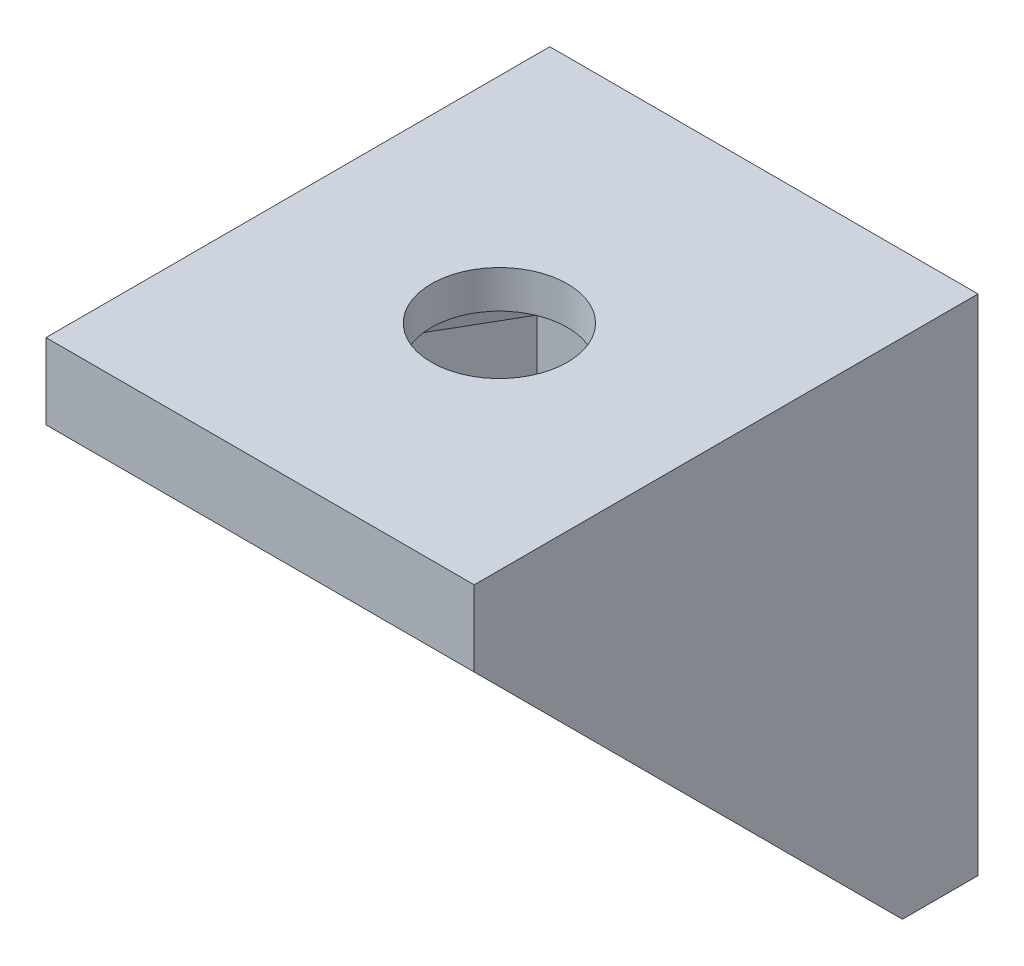
ISO-10303-21;
HEADER;
FILE_DESCRIPTION(('STEP AP214'),'2;1');
FILE_NAME('part.step','',(''),(''),'','','');
FILE_SCHEMA(('AUTOMOTIVE_DESIGN { 1 0 10303 214 1 1 1 1 }'));
ENDSEC;
DATA;
#1=APPLICATION_CONTEXT('core data for automotive mechanical design processes');
#2=APPLICATION_PROTOCOL_DEFINITION('international standard','automotive_design',2000,#1);
#3=PRODUCT_CONTEXT('',#1,'mechanical');
#4=PRODUCT('Part','Part','',(#3));
#5=PRODUCT_RELATED_PRODUCT_CATEGORY('part','',(#4));
#6=PRODUCT_DEFINITION_FORMATION('','',#4);
#7=PRODUCT_DEFINITION_CONTEXT('part definition',#1,'design');
#8=PRODUCT_DEFINITION('design','',#6,#7);
#9=PRODUCT_DEFINITION_SHAPE('','',#8);
#10=(LENGTH_UNIT() NAMED_UNIT(*) SI_UNIT(.MILLI.,.METRE.));
#11=(NAMED_UNIT(*) PLANE_ANGLE_UNIT() SI_UNIT($,.RADIAN.));
#12=(NAMED_UNIT(*) SI_UNIT($,.STERADIAN.) SOLID_ANGLE_UNIT());
#13=UNCERTAINTY_MEASURE_WITH_UNIT(LENGTH_MEASURE(1.E-05),#10,'distance_accuracy_value','');
#14=(GEOMETRIC_REPRESENTATION_CONTEXT(3) GLOBAL_UNCERTAINTY_ASSIGNED_CONTEXT((#13)) GLOBAL_UNIT_ASSIGNED_CONTEXT((#10,
#11,#12)) REPRESENTATION_CONTEXT('',''));
#15=CARTESIAN_POINT('',(0.,0.,0.));
#16=DIRECTION('',(0.,0.,1.));
#17=DIRECTION('',(1.,0.,0.));
#18=AXIS2_PLACEMENT_3D('',#15,#16,#17);
#19=CARTESIAN_POINT('',(-2.37310171513627E-12,-20.001,10.4999999999987));
#20=DIRECTION('',(0.,1.,0.));
#21=DIRECTION('',(0.,0.,1.));
#22=AXIS2_PLACEMENT_3D('',#19,#20,#21);
#23=CYLINDRICAL_SURFACE('',#22,2.7);
#24=CARTESIAN_POINT('',(-2.37310171513627E-12,0.,10.4999999999987));
#25=DIRECTION('',(0.,1.,0.));
#26=DIRECTION('',(0.,0.,1.));
#27=AXIS2_PLACEMENT_3D('',#24,#25,#26);
#28=CIRCLE('',#27,2.7);
#29=CARTESIAN_POINT('',(-2.37310171513627E-12,0.,13.1999999999987));
#30=VERTEX_POINT('',#29);
#31=EDGE_CURVE('E214',#30,#30,#28,.T.);
#32=ORIENTED_EDGE('',*,*,#31,.T.);
#33=EDGE_LOOP('',(#32));
#34=FACE_BOUND('',#33,.T.);
#35=CARTESIAN_POINT('',(-2.37310171513627E-12,-1.5,10.4999999999987));
#36=DIRECTION('',(0.,-1.,0.));
#37=DIRECTION('',(0.,0.,-1.));
#38=AXIS2_PLACEMENT_3D('',#35,#36,#37);
#39=CIRCLE('',#38,2.7);
#40=CARTESIAN_POINT('',(-2.37310171513627E-12,-1.5,7.79999999999873));
#41=VERTEX_POINT('',#40);
#42=EDGE_CURVE('E38',#41,#41,#39,.F.);
#43=ORIENTED_EDGE('',*,*,#42,.F.);
#44=EDGE_LOOP('',(#43));
#45=FACE_BOUND('',#44,.T.);
#46=ADVANCED_FACE('F34',(#34,#45),#23,.F.);
#47=CARTESIAN_POINT('',(8.5,-20.,2.99999999999999));
#48=DIRECTION('',(0.,0.707106781186548,-0.707106781186547));
#49=DIRECTION('',(0.,0.707106781186547,0.707106781186548));
#50=AXIS2_PLACEMENT_3D('',#47,#48,#49);
#51=PLANE('',#50);
#52=DIRECTION('',(0.,0.707106781186547,0.707106781186548));
#53=VECTOR('',#52,1.);
#54=CARTESIAN_POINT('',(6.,-20.,2.99999999999999));
#55=LINE('',#54,#53);
#56=CARTESIAN_POINT('',(6.,-20.,2.99999999999999));
#57=VERTEX_POINT('',#56);
#58=CARTESIAN_POINT('',(6.,-3.,20.));
#59=VERTEX_POINT('',#58);
#60=EDGE_CURVE('E43',#57,#59,#55,.T.);
#61=ORIENTED_EDGE('',*,*,#60,.F.);
#62=DIRECTION('',(-1.,0.,0.));
#63=VECTOR('',#62,1.);
#64=CARTESIAN_POINT('',(8.5,-20.,2.99999999999999));
#65=LINE('',#64,#63);
#66=CARTESIAN_POINT('',(8.5,-20.,2.99999999999999));
#67=VERTEX_POINT('',#66);
#68=EDGE_CURVE('E294',#67,#57,#65,.T.);
#69=ORIENTED_EDGE('',*,*,#68,.F.);
#70=DIRECTION('',(0.,-0.707106781186548,-0.707106781186548));
#71=VECTOR('',#70,1.);
#72=CARTESIAN_POINT('',(8.5,-3.,20.));
#73=LINE('',#72,#71);
#74=CARTESIAN_POINT('',(8.5,-3.,20.));
#75=VERTEX_POINT('',#74);
#76=EDGE_CURVE('E275',#75,#67,#73,.T.);
#77=ORIENTED_EDGE('',*,*,#76,.F.);
#78=DIRECTION('',(-1.,0.,0.));
#79=VECTOR('',#78,1.);
#80=CARTESIAN_POINT('',(8.5,-3.,20.));
#81=LINE('',#80,#79);
#82=EDGE_CURVE('E298',#75,#59,#81,.T.);
#83=ORIENTED_EDGE('',*,*,#82,.T.);
#84=EDGE_LOOP('',(#61,#69,#77,#83));
#85=FACE_BOUND('',#84,.T.);
#86=ADVANCED_FACE('F323',(#85),#51,.F.);
#87=CARTESIAN_POINT('',(8.5,0.,0.));
#88=DIRECTION('',(0.,0.,1.));
#89=DIRECTION('',(0.,-1.,0.));
#90=AXIS2_PLACEMENT_3D('',#87,#88,#89);
#91=PLANE('',#90);
#92=DIRECTION('',(0.,-1.,0.));
#93=VECTOR('',#92,1.);
#94=CARTESIAN_POINT('',(3.,-9.00000000000001,0.));
#95=LINE('',#94,#93);
#96=CARTESIAN_POINT('',(3.,-9.00000000000001,0.));
#97=VERTEX_POINT('',#96);
#98=CARTESIAN_POINT('',(3.,-12.,0.));
#99=VERTEX_POINT('',#98);
#100=EDGE_CURVE('E218',#97,#99,#95,.T.);
#101=ORIENTED_EDGE('',*,*,#100,.F.);
#102=CARTESIAN_POINT('',(0.,-9.00000000000001,0.));
#103=DIRECTION('',(0.,0.,1.));
#104=DIRECTION('',(0.,-1.,0.));
#105=AXIS2_PLACEMENT_3D('',#102,#103,#104);
#106=CIRCLE('',#105,3.);
#107=CARTESIAN_POINT('',(-3.,-9.00000000000001,0.));
#108=VERTEX_POINT('',#107);
#109=EDGE_CURVE('E221',#108,#97,#106,.F.);
#110=ORIENTED_EDGE('',*,*,#109,.F.);
#111=DIRECTION('',(0.,1.,0.));
#112=VECTOR('',#111,1.);
#113=CARTESIAN_POINT('',(-3.,-9.00000000000001,0.));
#114=LINE('',#113,#112);
#115=CARTESIAN_POINT('',(-3.,-12.,0.));
#116=VERTEX_POINT('',#115);
#117=EDGE_CURVE('E238',#116,#108,#114,.T.);
#118=ORIENTED_EDGE('',*,*,#117,.F.);
#119=CARTESIAN_POINT('',(0.,-12.,0.));
#120=DIRECTION('',(0.,0.,1.));
#121=DIRECTION('',(0.,-1.,0.));
#122=AXIS2_PLACEMENT_3D('',#119,#120,#121);
#123=CIRCLE('',#122,3.);
#124=EDGE_CURVE('E58',#99,#116,#123,.F.);
#125=ORIENTED_EDGE('',*,*,#124,.F.);
#126=EDGE_LOOP('',(#101,#110,#118,#125));
#127=FACE_BOUND('',#126,.T.);
#128=DIRECTION('',(0.,1.,0.));
#129=VECTOR('',#128,1.);
#130=CARTESIAN_POINT('',(-8.5,0.,0.));
#131=LINE('',#130,#129);
#132=CARTESIAN_POINT('',(-8.5,-20.,0.));
#133=VERTEX_POINT('',#132);
#134=CARTESIAN_POINT('',(-8.5,0.,0.));
#135=VERTEX_POINT('',#134);
#136=EDGE_CURVE('E262',#133,#135,#131,.T.);
#137=ORIENTED_EDGE('',*,*,#136,.T.);
#138=DIRECTION('',(-1.,0.,0.));
#139=VECTOR('',#138,1.);
#140=CARTESIAN_POINT('',(8.5,0.,0.));
#141=LINE('',#140,#139);
#142=CARTESIAN_POINT('',(8.5,0.,0.));
#143=VERTEX_POINT('',#142);
#144=EDGE_CURVE('E304',#143,#135,#141,.T.);
#145=ORIENTED_EDGE('',*,*,#144,.F.);
#146=DIRECTION('',(0.,1.,0.));
#147=VECTOR('',#146,1.);
#148=CARTESIAN_POINT('',(8.5,0.,0.));
#149=LINE('',#148,#147);
#150=CARTESIAN_POINT('',(8.5,-20.,0.));
#151=VERTEX_POINT('',#150);
#152=EDGE_CURVE('E267',#151,#143,#149,.T.);
#153=ORIENTED_EDGE('',*,*,#152,.F.);
#154=DIRECTION('',(-1.,0.,0.));
#155=VECTOR('',#154,1.);
#156=CARTESIAN_POINT('',(8.5,-20.,0.));
#157=LINE('',#156,#155);
#158=EDGE_CURVE('E279',#151,#133,#157,.T.);
#159=ORIENTED_EDGE('',*,*,#158,.T.);
#160=EDGE_LOOP('',(#137,#145,#153,#159));
#161=FACE_BOUND('',#160,.T.);
#162=ADVANCED_FACE('F36',(#127,#161),#91,.F.);
#163=CARTESIAN_POINT('',(8.5,0.,0.));
#164=DIRECTION('',(0.,-1.,0.));
#165=DIRECTION('',(0.,0.,-1.));
#166=AXIS2_PLACEMENT_3D('',#163,#164,#165);
#167=PLANE('',#166);
#168=ORIENTED_EDGE('',*,*,#31,.F.);
#169=EDGE_LOOP('',(#168));
#170=FACE_BOUND('',#169,.T.);
#171=DIRECTION('',(0.,0.,1.));
#172=VECTOR('',#171,1.);
#173=CARTESIAN_POINT('',(-8.5,0.,0.));
#174=LINE('',#173,#172);
#175=CARTESIAN_POINT('',(-8.5,0.,20.));
#176=VERTEX_POINT('',#175);
#177=EDGE_CURVE('E282',#135,#176,#174,.T.);
#178=ORIENTED_EDGE('',*,*,#177,.T.);
#179=DIRECTION('',(-1.,0.,0.));
#180=VECTOR('',#179,1.);
#181=CARTESIAN_POINT('',(8.5,0.,20.));
#182=LINE('',#181,#180);
#183=CARTESIAN_POINT('',(8.5,0.,20.));
#184=VERTEX_POINT('',#183);
#185=EDGE_CURVE('E301',#184,#176,#182,.T.);
#186=ORIENTED_EDGE('',*,*,#185,.F.);
#187=DIRECTION('',(0.,0.,1.));
#188=VECTOR('',#187,1.);
#189=CARTESIAN_POINT('',(8.5,0.,0.));
#190=LINE('',#189,#188);
#191=EDGE_CURVE('E270',#143,#184,#190,.T.);
#192=ORIENTED_EDGE('',*,*,#191,.F.);
#193=ORIENTED_EDGE('',*,*,#144,.T.);
#194=EDGE_LOOP('',(#178,#186,#192,#193));
#195=FACE_BOUND('',#194,.T.);
#196=ADVANCED_FACE('F350',(#170,#195),#167,.F.);
#197=CARTESIAN_POINT('',(8.5,0.,20.));
#198=DIRECTION('',(0.,0.,-1.));
#199=DIRECTION('',(-1.,0.,0.));
#200=AXIS2_PLACEMENT_3D('',#197,#198,#199);
#201=PLANE('',#200);
#202=DIRECTION('',(0.,-1.,0.));
#203=VECTOR('',#202,1.);
#204=CARTESIAN_POINT('',(-8.5,0.,20.));
#205=LINE('',#204,#203);
#206=CARTESIAN_POINT('',(-8.5,-3.,20.));
#207=VERTEX_POINT('',#206);
#208=EDGE_CURVE('E284',#176,#207,#205,.T.);
#209=ORIENTED_EDGE('',*,*,#208,.T.);
#210=CARTESIAN_POINT('',(-6.,-3.,20.));
#211=VERTEX_POINT('',#210);
#212=EDGE_CURVE('E297',#211,#207,#81,.T.);
#213=ORIENTED_EDGE('',*,*,#212,.F.);
#214=DIRECTION('',(1.,0.,0.));
#215=VECTOR('',#214,1.);
#216=CARTESIAN_POINT('',(-6.,-3.,20.));
#217=LINE('',#216,#215);
#218=EDGE_CURVE('E263',#211,#59,#217,.T.);
#219=ORIENTED_EDGE('',*,*,#218,.T.);
#220=ORIENTED_EDGE('',*,*,#82,.F.);
#221=DIRECTION('',(0.,-1.,0.));
#222=VECTOR('',#221,1.);
#223=CARTESIAN_POINT('',(8.5,0.,20.));
#224=LINE('',#223,#222);
#225=EDGE_CURVE('E273',#184,#75,#224,.T.);
#226=ORIENTED_EDGE('',*,*,#225,.F.);
#227=ORIENTED_EDGE('',*,*,#185,.T.);
#228=EDGE_LOOP('',(#209,#213,#219,#220,#226,#227));
#229=FACE_BOUND('',#228,.T.);
#230=ADVANCED_FACE('F320',(#229),#201,.F.);
#231=CARTESIAN_POINT('',(-6.,-20.,2.99999999999999));
#232=VERTEX_POINT('',#231);
#233=CARTESIAN_POINT('',(-8.5,-20.,2.99999999999999));
#234=VERTEX_POINT('',#233);
#235=EDGE_CURVE('E293',#232,#234,#65,.T.);
#236=ORIENTED_EDGE('',*,*,#235,.F.);
#237=DIRECTION('',(0.,0.707106781186547,0.707106781186548));
#238=VECTOR('',#237,1.);
#239=CARTESIAN_POINT('',(-6.,-20.,2.99999999999999));
#240=LINE('',#239,#238);
#241=EDGE_CURVE('E11',#232,#211,#240,.T.);
#242=ORIENTED_EDGE('',*,*,#241,.T.);
#243=ORIENTED_EDGE('',*,*,#212,.T.);
#244=DIRECTION('',(0.,-0.707106781186547,-0.707106781186548));
#245=VECTOR('',#244,1.);
#246=CARTESIAN_POINT('',(-8.5,-20.,2.99999999999999));
#247=LINE('',#246,#245);
#248=EDGE_CURVE('E287',#207,#234,#247,.T.);
#249=ORIENTED_EDGE('',*,*,#248,.T.);
#250=EDGE_LOOP('',(#236,#242,#243,#249));
#251=FACE_BOUND('',#250,.T.);
#252=ADVANCED_FACE('F338',(#251),#51,.F.);
#253=CARTESIAN_POINT('',(8.5,-20.,0.));
#254=DIRECTION('',(0.,1.,0.));
#255=DIRECTION('',(0.,0.,1.));
#256=AXIS2_PLACEMENT_3D('',#253,#254,#255);
#257=PLANE('',#256);
#258=DIRECTION('',(0.,0.,-1.));
#259=VECTOR('',#258,1.);
#260=CARTESIAN_POINT('',(-8.5,-20.,0.));
#261=LINE('',#260,#259);
#262=EDGE_CURVE('E271',#234,#133,#261,.T.);
#263=ORIENTED_EDGE('',*,*,#262,.T.);
#264=ORIENTED_EDGE('',*,*,#158,.F.);
#265=DIRECTION('',(0.,0.,-1.));
#266=VECTOR('',#265,1.);
#267=CARTESIAN_POINT('',(8.5,-20.,0.));
#268=LINE('',#267,#266);
#269=EDGE_CURVE('E277',#67,#151,#268,.T.);
#270=ORIENTED_EDGE('',*,*,#269,.F.);
#271=ORIENTED_EDGE('',*,*,#68,.T.);
#272=DIRECTION('',(1.,0.,0.));
#273=VECTOR('',#272,1.);
#274=CARTESIAN_POINT('',(-6.,-20.,2.99999999999999));
#275=LINE('',#274,#273);
#276=EDGE_CURVE('E260',#232,#57,#275,.T.);
#277=ORIENTED_EDGE('',*,*,#276,.F.);
#278=ORIENTED_EDGE('',*,*,#235,.T.);
#279=EDGE_LOOP('',(#263,#264,#270,#271,#277,#278));
#280=FACE_BOUND('',#279,.T.);
#281=ADVANCED_FACE('F346',(#280),#257,.F.);
#282=CARTESIAN_POINT('',(8.5,0.,0.));
#283=DIRECTION('',(-1.,0.,0.));
#284=DIRECTION('',(0.,0.,1.));
#285=AXIS2_PLACEMENT_3D('',#282,#283,#284);
#286=PLANE('',#285);
#287=ORIENTED_EDGE('',*,*,#152,.T.);
#288=ORIENTED_EDGE('',*,*,#191,.T.);
#289=ORIENTED_EDGE('',*,*,#225,.T.);
#290=ORIENTED_EDGE('',*,*,#76,.T.);
#291=ORIENTED_EDGE('',*,*,#269,.T.);
#292=EDGE_LOOP('',(#287,#288,#289,#290,#291));
#293=FACE_BOUND('',#292,.T.);
#294=ADVANCED_FACE('F326',(#293),#286,.F.);
#295=CARTESIAN_POINT('',(-8.5,0.,0.));
#296=DIRECTION('',(-1.,0.,0.));
#297=DIRECTION('',(0.,0.,1.));
#298=AXIS2_PLACEMENT_3D('',#295,#296,#297);
#299=PLANE('',#298);
#300=ORIENTED_EDGE('',*,*,#136,.F.);
#301=ORIENTED_EDGE('',*,*,#262,.F.);
#302=ORIENTED_EDGE('',*,*,#248,.F.);
#303=ORIENTED_EDGE('',*,*,#208,.F.);
#304=ORIENTED_EDGE('',*,*,#177,.F.);
#305=EDGE_LOOP('',(#300,#301,#302,#303,#304));
#306=FACE_BOUND('',#305,.T.);
#307=ADVANCED_FACE('F334',(#306),#299,.T.);
#308=CARTESIAN_POINT('',(-6.,0.,0.));
#309=DIRECTION('',(-1.,0.,0.));
#310=DIRECTION('',(0.,0.,1.));
#311=AXIS2_PLACEMENT_3D('',#308,#309,#310);
#312=PLANE('',#311);
#313=DIRECTION('',(0.,1.,0.));
#314=VECTOR('',#313,1.);
#315=CARTESIAN_POINT('',(-6.,-3.,2.99999999999999));
#316=LINE('',#315,#314);
#317=CARTESIAN_POINT('',(-6.,-3.,2.99999999999999));
#318=VERTEX_POINT('',#317);
#319=EDGE_CURVE('E248',#232,#318,#316,.T.);
#320=ORIENTED_EDGE('',*,*,#319,.T.);
#321=DIRECTION('',(0.,0.,1.));
#322=VECTOR('',#321,1.);
#323=CARTESIAN_POINT('',(-6.,-3.,2.99999999999999));
#324=LINE('',#323,#322);
#325=EDGE_CURVE('E251',#318,#211,#324,.T.);
#326=ORIENTED_EDGE('',*,*,#325,.T.);
#327=ORIENTED_EDGE('',*,*,#241,.F.);
#328=EDGE_LOOP('',(#320,#326,#327));
#329=FACE_BOUND('',#328,.T.);
#330=ADVANCED_FACE('F342',(#329),#312,.F.);
#331=CARTESIAN_POINT('',(6.,0.,0.));
#332=DIRECTION('',(-1.,0.,0.));
#333=DIRECTION('',(0.,0.,1.));
#334=AXIS2_PLACEMENT_3D('',#331,#332,#333);
#335=PLANE('',#334);
#336=ORIENTED_EDGE('',*,*,#60,.T.);
#337=DIRECTION('',(0.,0.,1.));
#338=VECTOR('',#337,1.);
#339=CARTESIAN_POINT('',(6.,-3.,2.99999999999999));
#340=LINE('',#339,#338);
#341=CARTESIAN_POINT('',(6.,-3.,2.99999999999999));
#342=VERTEX_POINT('',#341);
#343=EDGE_CURVE('E252',#342,#59,#340,.T.);
#344=ORIENTED_EDGE('',*,*,#343,.F.);
#345=DIRECTION('',(0.,1.,0.));
#346=VECTOR('',#345,1.);
#347=CARTESIAN_POINT('',(6.,-3.,2.99999999999999));
#348=LINE('',#347,#346);
#349=EDGE_CURVE('E247',#57,#342,#348,.T.);
#350=ORIENTED_EDGE('',*,*,#349,.F.);
#351=EDGE_LOOP('',(#336,#344,#350));
#352=FACE_BOUND('',#351,.T.);
#353=ADVANCED_FACE('F311',(#352),#335,.T.);
#354=CARTESIAN_POINT('',(-6.,-3.,2.99999999999999));
#355=DIRECTION('',(0.,0.,-1.));
#356=DIRECTION('',(0.,1.,0.));
#357=AXIS2_PLACEMENT_3D('',#354,#355,#356);
#358=PLANE('',#357);
#359=DIRECTION('',(0.,-1.,0.));
#360=VECTOR('',#359,1.);
#361=CARTESIAN_POINT('',(-3.,-9.00000000000001,2.99999999999999));
#362=LINE('',#361,#360);
#363=CARTESIAN_POINT('',(-3.,-9.00000000000001,2.99999999999999));
#364=VERTEX_POINT('',#363);
#365=CARTESIAN_POINT('',(-3.,-12.,2.99999999999999));
#366=VERTEX_POINT('',#365);
#367=EDGE_CURVE('E226',#364,#366,#362,.T.);
#368=ORIENTED_EDGE('',*,*,#367,.F.);
#369=CARTESIAN_POINT('',(0.,-9.00000000000001,2.99999999999999));
#370=DIRECTION('',(0.,0.,1.));
#371=DIRECTION('',(-1.,0.,0.));
#372=AXIS2_PLACEMENT_3D('',#369,#370,#371);
#373=CIRCLE('',#372,3.);
#374=CARTESIAN_POINT('',(3.,-9.00000000000001,2.99999999999999));
#375=VERTEX_POINT('',#374);
#376=EDGE_CURVE('E224',#375,#364,#373,.T.);
#377=ORIENTED_EDGE('',*,*,#376,.F.);
#378=DIRECTION('',(0.,1.,0.));
#379=VECTOR('',#378,1.);
#380=CARTESIAN_POINT('',(3.,-9.00000000000001,2.99999999999999));
#381=LINE('',#380,#379);
#382=CARTESIAN_POINT('',(3.,-12.,2.99999999999999));
#383=VERTEX_POINT('',#382);
#384=EDGE_CURVE('E232',#383,#375,#381,.T.);
#385=ORIENTED_EDGE('',*,*,#384,.F.);
#386=CARTESIAN_POINT('',(0.,-12.,2.99999999999999));
#387=DIRECTION('',(0.,0.,1.));
#388=DIRECTION('',(1.,0.,0.));
#389=AXIS2_PLACEMENT_3D('',#386,#387,#388);
#390=CIRCLE('',#389,3.);
#391=EDGE_CURVE('E229',#366,#383,#390,.T.);
#392=ORIENTED_EDGE('',*,*,#391,.F.);
#393=EDGE_LOOP('',(#368,#377,#385,#392));
#394=FACE_BOUND('',#393,.T.);
#395=ORIENTED_EDGE('',*,*,#349,.T.);
#396=DIRECTION('',(1.,0.,0.));
#397=VECTOR('',#396,1.);
#398=CARTESIAN_POINT('',(-6.,-3.,2.99999999999999));
#399=LINE('',#398,#397);
#400=EDGE_CURVE('E255',#318,#342,#399,.T.);
#401=ORIENTED_EDGE('',*,*,#400,.F.);
#402=ORIENTED_EDGE('',*,*,#319,.F.);
#403=ORIENTED_EDGE('',*,*,#276,.T.);
#404=EDGE_LOOP('',(#395,#401,#402,#403));
#405=FACE_BOUND('',#404,.T.);
#406=ADVANCED_FACE('F344',(#394,#405),#358,.F.);
#407=CARTESIAN_POINT('',(-6.,-3.,2.99999999999999));
#408=DIRECTION('',(0.,1.,0.));
#409=DIRECTION('',(0.,0.,1.));
#410=AXIS2_PLACEMENT_3D('',#407,#408,#409);
#411=PLANE('',#410);
#412=DIRECTION('',(-1.,0.,0.));
#413=VECTOR('',#412,1.);
#414=CARTESIAN_POINT('',(-2.38746936166375E-12,-3.,14.6999999999987));
#415=LINE('',#414,#413);
#416=CARTESIAN_POINT('',(2.42487113059404,-3.,14.6999999999987));
#417=VERTEX_POINT('',#416);
#418=CARTESIAN_POINT('',(-2.42487113059886,-3.,14.6999999999987));
#419=VERTEX_POINT('',#418);
#420=EDGE_CURVE('E175',#417,#419,#415,.T.);
#421=ORIENTED_EDGE('',*,*,#420,.F.);
#422=DIRECTION('',(-0.500000000000028,0.,0.866025403784422));
#423=VECTOR('',#422,1.);
#424=CARTESIAN_POINT('',(3.63730669589231,-3.,12.5999999999988));
#425=LINE('',#424,#423);
#426=CARTESIAN_POINT('',(4.84974226119052,-3.,10.4999999999988));
#427=VERTEX_POINT('',#426);
#428=EDGE_CURVE('E50',#427,#417,#425,.T.);
#429=ORIENTED_EDGE('',*,*,#428,.F.);
#430=DIRECTION('',(0.499999999999985,0.,0.866025403784448));
#431=VECTOR('',#430,1.);
#432=CARTESIAN_POINT('',(3.63730669589228,-3.,8.3999999999987));
#433=LINE('',#432,#431);
#434=CARTESIAN_POINT('',(2.42487113059409,-3.,6.29999999999875));
#435=VERTEX_POINT('',#434);
#436=EDGE_CURVE('E201',#435,#427,#433,.T.);
#437=ORIENTED_EDGE('',*,*,#436,.F.);
#438=DIRECTION('',(1.,0.,0.));
#439=VECTOR('',#438,1.);
#440=CARTESIAN_POINT('',(-2.38654582207509E-12,-3.,6.29999999999875));
#441=LINE('',#440,#439);
#442=CARTESIAN_POINT('',(-2.42487113059881,-3.,6.29999999999875));
#443=VERTEX_POINT('',#442);
#444=EDGE_CURVE('E198',#443,#435,#441,.T.);
#445=ORIENTED_EDGE('',*,*,#444,.F.);
#446=DIRECTION('',(0.500000000000008,0.,-0.866025403784434));
#447=VECTOR('',#446,1.);
#448=CARTESIAN_POINT('',(-3.63730669589703,-3.,8.3999999999987));
#449=LINE('',#448,#447);
#450=CARTESIAN_POINT('',(-4.84974226119526,-3.,10.4999999999987));
#451=VERTEX_POINT('',#450);
#452=EDGE_CURVE('E195',#451,#443,#449,.T.);
#453=ORIENTED_EDGE('',*,*,#452,.F.);
#454=DIRECTION('',(-0.499999999999985,0.,-0.866025403784447));
#455=VECTOR('',#454,1.);
#456=CARTESIAN_POINT('',(-3.63730669589705,-3.,12.5999999999988));
#457=LINE('',#456,#455);
#458=EDGE_CURVE('E193',#419,#451,#457,.T.);
#459=ORIENTED_EDGE('',*,*,#458,.F.);
#460=EDGE_LOOP('',(#421,#429,#437,#445,#453,#459));
#461=FACE_BOUND('',#460,.T.);
#462=ORIENTED_EDGE('',*,*,#343,.T.);
#463=ORIENTED_EDGE('',*,*,#218,.F.);
#464=ORIENTED_EDGE('',*,*,#325,.F.);
#465=ORIENTED_EDGE('',*,*,#400,.T.);
#466=EDGE_LOOP('',(#462,#463,#464,#465));
#467=FACE_BOUND('',#466,.T.);
#468=ADVANCED_FACE('F315',(#461,#467),#411,.F.);
#469=CARTESIAN_POINT('',(0.,-9.00000000000001,-0.00100000000001401));
#470=DIRECTION('',(0.,0.,1.));
#471=DIRECTION('',(1.,0.,0.));
#472=AXIS2_PLACEMENT_3D('',#469,#470,#471);
#473=CYLINDRICAL_SURFACE('',#472,3.);
#474=ORIENTED_EDGE('',*,*,#109,.T.);
#475=DIRECTION('',(0.,0.,1.));
#476=VECTOR('',#475,1.);
#477=CARTESIAN_POINT('',(3.,-9.00000000000001,-0.00100000000001401));
#478=LINE('',#477,#476);
#479=EDGE_CURVE('E236',#97,#375,#478,.T.);
#480=ORIENTED_EDGE('',*,*,#479,.T.);
#481=ORIENTED_EDGE('',*,*,#376,.T.);
#482=DIRECTION('',(0.,0.,1.));
#483=VECTOR('',#482,1.);
#484=CARTESIAN_POINT('',(-3.,-9.00000000000001,-0.00100000000001401));
#485=LINE('',#484,#483);
#486=EDGE_CURVE('E235',#108,#364,#485,.T.);
#487=ORIENTED_EDGE('',*,*,#486,.F.);
#488=EDGE_LOOP('',(#474,#480,#481,#487));
#489=FACE_BOUND('',#488,.T.);
#490=ADVANCED_FACE('F378',(#489),#473,.F.);
#491=CARTESIAN_POINT('',(3.,-9.00000000000001,-0.00100000000001401));
#492=DIRECTION('',(1.,0.,0.));
#493=DIRECTION('',(0.,1.,0.));
#494=AXIS2_PLACEMENT_3D('',#491,#492,#493);
#495=PLANE('',#494);
#496=ORIENTED_EDGE('',*,*,#100,.T.);
#497=DIRECTION('',(0.,0.,1.));
#498=VECTOR('',#497,1.);
#499=CARTESIAN_POINT('',(3.,-12.,-0.00100000000001401));
#500=LINE('',#499,#498);
#501=EDGE_CURVE('E239',#99,#383,#500,.T.);
#502=ORIENTED_EDGE('',*,*,#501,.T.);
#503=ORIENTED_EDGE('',*,*,#384,.T.);
#504=ORIENTED_EDGE('',*,*,#479,.F.);
#505=EDGE_LOOP('',(#496,#502,#503,#504));
#506=FACE_BOUND('',#505,.T.);
#507=ADVANCED_FACE('F374',(#506),#495,.F.);
#508=CARTESIAN_POINT('',(0.,-12.,-0.00100000000001401));
#509=DIRECTION('',(0.,0.,1.));
#510=DIRECTION('',(1.,0.,0.));
#511=AXIS2_PLACEMENT_3D('',#508,#509,#510);
#512=CYLINDRICAL_SURFACE('',#511,3.);
#513=ORIENTED_EDGE('',*,*,#124,.T.);
#514=DIRECTION('',(0.,0.,1.));
#515=VECTOR('',#514,1.);
#516=CARTESIAN_POINT('',(-3.,-12.,-0.00100000000001401));
#517=LINE('',#516,#515);
#518=EDGE_CURVE('E241',#116,#366,#517,.T.);
#519=ORIENTED_EDGE('',*,*,#518,.T.);
#520=ORIENTED_EDGE('',*,*,#391,.T.);
#521=ORIENTED_EDGE('',*,*,#501,.F.);
#522=EDGE_LOOP('',(#513,#519,#520,#521));
#523=FACE_BOUND('',#522,.T.);
#524=ADVANCED_FACE('F377',(#523),#512,.F.);
#525=CARTESIAN_POINT('',(-3.,-9.00000000000001,-0.00100000000001401));
#526=DIRECTION('',(-1.,0.,0.));
#527=DIRECTION('',(0.,-1.,0.));
#528=AXIS2_PLACEMENT_3D('',#525,#526,#527);
#529=PLANE('',#528);
#530=ORIENTED_EDGE('',*,*,#117,.T.);
#531=ORIENTED_EDGE('',*,*,#486,.T.);
#532=ORIENTED_EDGE('',*,*,#367,.T.);
#533=ORIENTED_EDGE('',*,*,#518,.F.);
#534=EDGE_LOOP('',(#530,#531,#532,#533));
#535=FACE_BOUND('',#534,.T.);
#536=ADVANCED_FACE('F382',(#535),#529,.F.);
#537=CARTESIAN_POINT('',(0.,-1.5,0.));
#538=DIRECTION('',(0.,-1.,0.));
#539=DIRECTION('',(0.,0.,-1.));
#540=AXIS2_PLACEMENT_3D('',#537,#538,#539);
#541=PLANE('',#540);
#542=DIRECTION('',(-1.,0.,0.));
#543=VECTOR('',#542,1.);
#544=CARTESIAN_POINT('',(2.42487113059404,-1.5,14.6999999999987));
#545=LINE('',#544,#543);
#546=CARTESIAN_POINT('',(2.42487113059404,-1.5,14.6999999999987));
#547=VERTEX_POINT('',#546);
#548=CARTESIAN_POINT('',(-2.42487113059886,-1.5,14.6999999999987));
#549=VERTEX_POINT('',#548);
#550=EDGE_CURVE('E160',#547,#549,#545,.T.);
#551=ORIENTED_EDGE('',*,*,#550,.T.);
#552=DIRECTION('',(-0.5,0.,-0.866025403784439));
#553=VECTOR('',#552,1.);
#554=CARTESIAN_POINT('',(-2.42487113059886,-1.5,14.6999999999987));
#555=LINE('',#554,#553);
#556=CARTESIAN_POINT('',(-4.84974226119526,-1.5,10.4999999999987));
#557=VERTEX_POINT('',#556);
#558=EDGE_CURVE('E165',#549,#557,#555,.T.);
#559=ORIENTED_EDGE('',*,*,#558,.T.);
#560=DIRECTION('',(0.5,0.,-0.866025403784439));
#561=VECTOR('',#560,1.);
#562=CARTESIAN_POINT('',(-4.84974226119526,-1.5,10.4999999999987));
#563=LINE('',#562,#561);
#564=CARTESIAN_POINT('',(-2.42487113059881,-1.5,6.29999999999875));
#565=VERTEX_POINT('',#564);
#566=EDGE_CURVE('E183',#557,#565,#563,.T.);
#567=ORIENTED_EDGE('',*,*,#566,.T.);
#568=DIRECTION('',(1.,0.,0.));
#569=VECTOR('',#568,1.);
#570=CARTESIAN_POINT('',(-2.42487113059881,-1.5,6.29999999999875));
#571=LINE('',#570,#569);
#572=CARTESIAN_POINT('',(2.42487113059409,-1.5,6.29999999999875));
#573=VERTEX_POINT('',#572);
#574=EDGE_CURVE('E185',#565,#573,#571,.T.);
#575=ORIENTED_EDGE('',*,*,#574,.T.);
#576=DIRECTION('',(0.5,0.,0.866025403784439));
#577=VECTOR('',#576,1.);
#578=CARTESIAN_POINT('',(2.42487113059409,-1.5,6.29999999999875));
#579=LINE('',#578,#577);
#580=CARTESIAN_POINT('',(4.84974226119052,-1.5,10.4999999999988));
#581=VERTEX_POINT('',#580);
#582=EDGE_CURVE('E189',#573,#581,#579,.T.);
#583=ORIENTED_EDGE('',*,*,#582,.T.);
#584=DIRECTION('',(-0.5,0.,0.866025403784439));
#585=VECTOR('',#584,1.);
#586=CARTESIAN_POINT('',(4.84974226119052,-1.5,10.4999999999988));
#587=LINE('',#586,#585);
#588=EDGE_CURVE('E168',#581,#547,#587,.T.);
#589=ORIENTED_EDGE('',*,*,#588,.T.);
#590=EDGE_LOOP('',(#551,#559,#567,#575,#583,#589));
#591=FACE_BOUND('',#590,.T.);
#592=ORIENTED_EDGE('',*,*,#42,.T.);
#593=EDGE_LOOP('',(#592));
#594=FACE_BOUND('',#593,.T.);
#595=ADVANCED_FACE('F162',(#591,#594),#541,.T.);
#596=CARTESIAN_POINT('',(3.63730669589231,-1.5,12.5999999999988));
#597=DIRECTION('',(0.866025403784422,0.,0.500000000000028));
#598=DIRECTION('',(0.500000000000028,0.,-0.866025403784422));
#599=AXIS2_PLACEMENT_3D('',#596,#597,#598);
#600=PLANE('',#599);
#601=ORIENTED_EDGE('',*,*,#428,.T.);
#602=DIRECTION('',(0.,-1.,0.));
#603=VECTOR('',#602,1.);
#604=CARTESIAN_POINT('',(2.42487113059404,-1.5,14.6999999999987));
#605=LINE('',#604,#603);
#606=EDGE_CURVE('E205',#547,#417,#605,.T.);
#607=ORIENTED_EDGE('',*,*,#606,.F.);
#608=ORIENTED_EDGE('',*,*,#588,.F.);
#609=DIRECTION('',(0.,-1.,0.));
#610=VECTOR('',#609,1.);
#611=CARTESIAN_POINT('',(4.84974226119052,-1.5,10.4999999999988));
#612=LINE('',#611,#610);
#613=EDGE_CURVE('E207',#581,#427,#612,.T.);
#614=ORIENTED_EDGE('',*,*,#613,.T.);
#615=EDGE_LOOP('',(#601,#607,#608,#614));
#616=FACE_BOUND('',#615,.T.);
#617=ADVANCED_FACE('F470',(#616),#600,.F.);
#618=CARTESIAN_POINT('',(3.63730669589228,-1.5,8.3999999999987));
#619=DIRECTION('',(0.866025403784447,0.,-0.499999999999985));
#620=DIRECTION('',(-0.499999999999985,0.,-0.866025403784448));
#621=AXIS2_PLACEMENT_3D('',#618,#619,#620);
#622=PLANE('',#621);
#623=ORIENTED_EDGE('',*,*,#436,.T.);
#624=ORIENTED_EDGE('',*,*,#613,.F.);
#625=ORIENTED_EDGE('',*,*,#582,.F.);
#626=DIRECTION('',(0.,-1.,0.));
#627=VECTOR('',#626,1.);
#628=CARTESIAN_POINT('',(2.42487113059409,-1.5,6.29999999999875));
#629=LINE('',#628,#627);
#630=EDGE_CURVE('E209',#573,#435,#629,.T.);
#631=ORIENTED_EDGE('',*,*,#630,.T.);
#632=EDGE_LOOP('',(#623,#624,#625,#631));
#633=FACE_BOUND('',#632,.T.);
#634=ADVANCED_FACE('F478',(#633),#622,.F.);
#635=CARTESIAN_POINT('',(-2.38654582207509E-12,-1.5,6.29999999999875));
#636=DIRECTION('',(0.,0.,-1.));
#637=DIRECTION('',(0.,1.,0.));
#638=AXIS2_PLACEMENT_3D('',#635,#636,#637);
#639=PLANE('',#638);
#640=ORIENTED_EDGE('',*,*,#444,.T.);
#641=ORIENTED_EDGE('',*,*,#630,.F.);
#642=ORIENTED_EDGE('',*,*,#574,.F.);
#643=DIRECTION('',(0.,-1.,0.));
#644=VECTOR('',#643,1.);
#645=CARTESIAN_POINT('',(-2.42487113059881,-1.5,6.29999999999875));
#646=LINE('',#645,#644);
#647=EDGE_CURVE('E211',#565,#443,#646,.T.);
#648=ORIENTED_EDGE('',*,*,#647,.T.);
#649=EDGE_LOOP('',(#640,#641,#642,#648));
#650=FACE_BOUND('',#649,.T.);
#651=ADVANCED_FACE('F489',(#650),#639,.F.);
#652=CARTESIAN_POINT('',(-3.63730669589703,-1.5,8.3999999999987));
#653=DIRECTION('',(-0.866025403784434,0.,-0.500000000000008));
#654=DIRECTION('',(-0.500000000000008,0.,0.866025403784434));
#655=AXIS2_PLACEMENT_3D('',#652,#653,#654);
#656=PLANE('',#655);
#657=ORIENTED_EDGE('',*,*,#452,.T.);
#658=ORIENTED_EDGE('',*,*,#647,.F.);
#659=ORIENTED_EDGE('',*,*,#566,.F.);
#660=DIRECTION('',(0.,-1.,0.));
#661=VECTOR('',#660,1.);
#662=CARTESIAN_POINT('',(-4.84974226119526,-1.5,10.4999999999987));
#663=LINE('',#662,#661);
#664=EDGE_CURVE('E179',#557,#451,#663,.T.);
#665=ORIENTED_EDGE('',*,*,#664,.T.);
#666=EDGE_LOOP('',(#657,#658,#659,#665));
#667=FACE_BOUND('',#666,.T.);
#668=ADVANCED_FACE('F501',(#667),#656,.F.);
#669=CARTESIAN_POINT('',(-3.63730669589705,-1.5,12.5999999999988));
#670=DIRECTION('',(-0.866025403784447,0.,0.499999999999985));
#671=DIRECTION('',(0.499999999999985,0.,0.866025403784447));
#672=AXIS2_PLACEMENT_3D('',#669,#670,#671);
#673=PLANE('',#672);
#674=ORIENTED_EDGE('',*,*,#458,.T.);
#675=ORIENTED_EDGE('',*,*,#664,.F.);
#676=ORIENTED_EDGE('',*,*,#558,.F.);
#677=DIRECTION('',(0.,-1.,0.));
#678=VECTOR('',#677,1.);
#679=CARTESIAN_POINT('',(-2.42487113059886,-1.5,14.6999999999987));
#680=LINE('',#679,#678);
#681=EDGE_CURVE('E172',#549,#419,#680,.T.);
#682=ORIENTED_EDGE('',*,*,#681,.T.);
#683=EDGE_LOOP('',(#674,#675,#676,#682));
#684=FACE_BOUND('',#683,.T.);
#685=ADVANCED_FACE('F181',(#684),#673,.F.);
#686=CARTESIAN_POINT('',(-2.38746936166375E-12,-1.5,14.6999999999987));
#687=DIRECTION('',(0.,0.,1.));
#688=DIRECTION('',(0.,-1.,0.));
#689=AXIS2_PLACEMENT_3D('',#686,#687,#688);
#690=PLANE('',#689);
#691=ORIENTED_EDGE('',*,*,#420,.T.);
#692=ORIENTED_EDGE('',*,*,#681,.F.);
#693=ORIENTED_EDGE('',*,*,#550,.F.);
#694=ORIENTED_EDGE('',*,*,#606,.T.);
#695=EDGE_LOOP('',(#691,#692,#693,#694));
#696=FACE_BOUND('',#695,.T.);
#697=ADVANCED_FACE('F173',(#696),#690,.F.);
#698=CLOSED_SHELL('',(#46,#86,#162,#196,#230,#252,#281,#294,#307,#330,#353,#406,#468,#490,#507,
#524,#536,#595,#617,#634,#651,#668,#685,#697));
#699=MANIFOLD_SOLID_BREP('B2',#698);
#700=ADVANCED_BREP_SHAPE_REPRESENTATION('',(#18,#699),#14);
#701=SHAPE_DEFINITION_REPRESENTATION(#9,#700);
ENDSEC;
END-ISO-10303-21;
